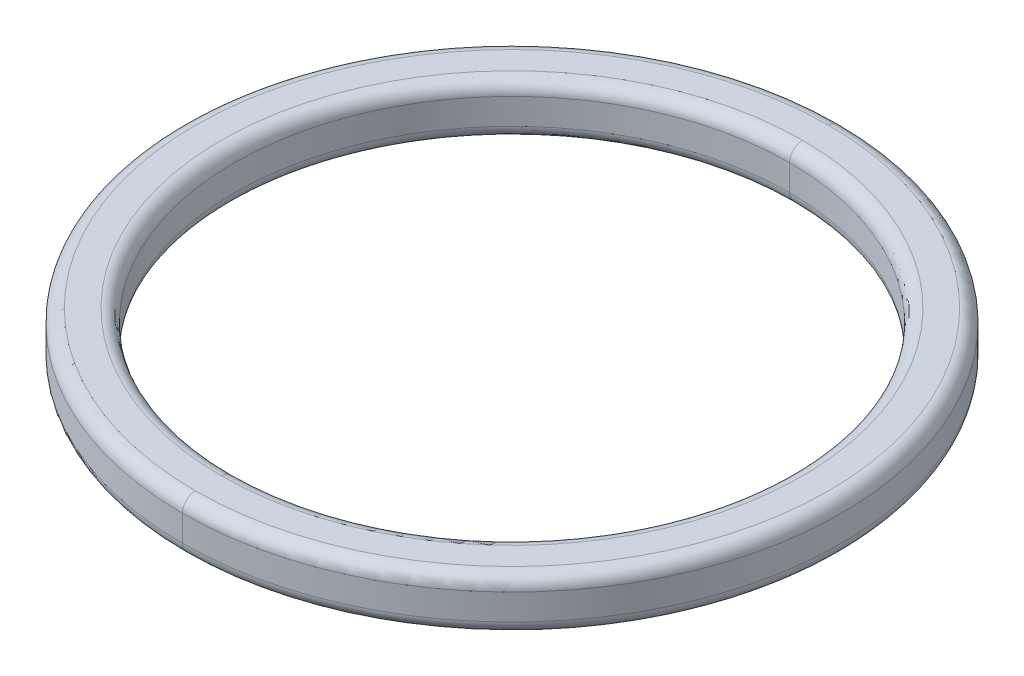
ISO-10303-21;
HEADER;
FILE_DESCRIPTION(('STEP AP214'),'2;1');
FILE_NAME('part.step','',(''),(''),'','','');
FILE_SCHEMA(('AUTOMOTIVE_DESIGN { 1 0 10303 214 1 1 1 1 }'));
ENDSEC;
DATA;
#1=APPLICATION_CONTEXT('core data for automotive mechanical design processes');
#2=APPLICATION_PROTOCOL_DEFINITION('international standard','automotive_design',2000,#1);
#3=PRODUCT_CONTEXT('',#1,'mechanical');
#4=PRODUCT('Part','Part','',(#3));
#5=PRODUCT_RELATED_PRODUCT_CATEGORY('part','',(#4));
#6=PRODUCT_DEFINITION_FORMATION('','',#4);
#7=PRODUCT_DEFINITION_CONTEXT('part definition',#1,'design');
#8=PRODUCT_DEFINITION('design','',#6,#7);
#9=PRODUCT_DEFINITION_SHAPE('','',#8);
#10=(LENGTH_UNIT() NAMED_UNIT(*) SI_UNIT(.MILLI.,.METRE.));
#11=(NAMED_UNIT(*) PLANE_ANGLE_UNIT() SI_UNIT($,.RADIAN.));
#12=(NAMED_UNIT(*) SI_UNIT($,.STERADIAN.) SOLID_ANGLE_UNIT());
#13=UNCERTAINTY_MEASURE_WITH_UNIT(LENGTH_MEASURE(1.E-05),#10,'distance_accuracy_value','');
#14=(GEOMETRIC_REPRESENTATION_CONTEXT(3) GLOBAL_UNCERTAINTY_ASSIGNED_CONTEXT((#13)) GLOBAL_UNIT_ASSIGNED_CONTEXT((#10,
#11,#12)) REPRESENTATION_CONTEXT('',''));
#15=CARTESIAN_POINT('',(0.,0.,0.));
#16=DIRECTION('',(0.,0.,1.));
#17=DIRECTION('',(1.,0.,0.));
#18=AXIS2_PLACEMENT_3D('',#15,#16,#17);
#19=CARTESIAN_POINT('',(0.,0.25,0.));
#20=DIRECTION('',(0.,-1.,0.));
#21=DIRECTION('',(0.,0.,-1.));
#22=AXIS2_PLACEMENT_3D('',#19,#20,#21);
#23=TOROIDAL_SURFACE('',#22,6.1,0.25);
#24=CARTESIAN_POINT('',(0.,0.25,6.1));
#25=DIRECTION('',(1.,0.,0.));
#26=DIRECTION('',(0.,0.,-1.));
#27=AXIS2_PLACEMENT_3D('',#24,#25,#26);
#28=CIRCLE('',#27,0.25);
#29=CARTESIAN_POINT('',(0.,0.5,6.1));
#30=VERTEX_POINT('',#29);
#31=CARTESIAN_POINT('',(0.,0.25,6.35));
#32=VERTEX_POINT('',#31);
#33=EDGE_CURVE('E163',#30,#32,#28,.T.);
#34=ORIENTED_EDGE('',*,*,#33,.F.);
#35=CARTESIAN_POINT('',(0.,0.5,0.));
#36=DIRECTION('',(0.,1.,0.));
#37=DIRECTION('',(0.,0.,-1.));
#38=AXIS2_PLACEMENT_3D('',#35,#36,#37);
#39=CIRCLE('',#38,6.1);
#40=CARTESIAN_POINT('',(0.,0.5,-6.1));
#41=VERTEX_POINT('',#40);
#42=EDGE_CURVE('E25',#41,#30,#39,.T.);
#43=ORIENTED_EDGE('',*,*,#42,.F.);
#44=CARTESIAN_POINT('',(0.,0.25,-6.1));
#45=DIRECTION('',(-1.,0.,0.));
#46=DIRECTION('',(0.,0.,1.));
#47=AXIS2_PLACEMENT_3D('',#44,#45,#46);
#48=CIRCLE('',#47,0.25);
#49=CARTESIAN_POINT('',(0.,0.25,-6.35));
#50=VERTEX_POINT('',#49);
#51=EDGE_CURVE('E115',#41,#50,#48,.T.);
#52=ORIENTED_EDGE('',*,*,#51,.T.);
#53=CARTESIAN_POINT('',(0.,0.25,0.));
#54=DIRECTION('',(0.,-1.,0.));
#55=DIRECTION('',(0.,0.,-1.));
#56=AXIS2_PLACEMENT_3D('',#53,#54,#55);
#57=CIRCLE('',#56,6.35);
#58=EDGE_CURVE('E119',#32,#50,#57,.T.);
#59=ORIENTED_EDGE('',*,*,#58,.F.);
#60=EDGE_LOOP('',(#34,#43,#52,#59));
#61=FACE_BOUND('',#60,.T.);
#62=ADVANCED_FACE('F14',(#61),#23,.T.);
#63=CARTESIAN_POINT('',(0.,0.25,0.));
#64=DIRECTION('',(0.,-1.,0.));
#65=DIRECTION('',(0.,0.,-1.));
#66=AXIS2_PLACEMENT_3D('',#63,#64,#65);
#67=TOROIDAL_SURFACE('',#66,5.6,0.25);
#68=CARTESIAN_POINT('',(0.,0.25,5.6));
#69=DIRECTION('',(1.,0.,0.));
#70=DIRECTION('',(0.,0.,-1.));
#71=AXIS2_PLACEMENT_3D('',#68,#69,#70);
#72=CIRCLE('',#71,0.25);
#73=CARTESIAN_POINT('',(0.,0.25,5.35));
#74=VERTEX_POINT('',#73);
#75=CARTESIAN_POINT('',(0.,0.5,5.6));
#76=VERTEX_POINT('',#75);
#77=EDGE_CURVE('E94',#74,#76,#72,.T.);
#78=ORIENTED_EDGE('',*,*,#77,.F.);
#79=CARTESIAN_POINT('',(0.,0.25,0.));
#80=DIRECTION('',(0.,1.,0.));
#81=DIRECTION('',(0.,0.,-1.));
#82=AXIS2_PLACEMENT_3D('',#79,#80,#81);
#83=CIRCLE('',#82,5.35);
#84=CARTESIAN_POINT('',(0.,0.25,-5.35));
#85=VERTEX_POINT('',#84);
#86=EDGE_CURVE('E122',#85,#74,#83,.T.);
#87=ORIENTED_EDGE('',*,*,#86,.F.);
#88=CARTESIAN_POINT('',(0.,0.25,-5.6));
#89=DIRECTION('',(-1.,0.,0.));
#90=DIRECTION('',(0.,0.,1.));
#91=AXIS2_PLACEMENT_3D('',#88,#89,#90);
#92=CIRCLE('',#91,0.25);
#93=CARTESIAN_POINT('',(0.,0.5,-5.6));
#94=VERTEX_POINT('',#93);
#95=EDGE_CURVE('E97',#85,#94,#92,.T.);
#96=ORIENTED_EDGE('',*,*,#95,.T.);
#97=CARTESIAN_POINT('',(0.,0.5,0.));
#98=DIRECTION('',(0.,-1.,0.));
#99=DIRECTION('',(0.,0.,-1.));
#100=AXIS2_PLACEMENT_3D('',#97,#98,#99);
#101=CIRCLE('',#100,5.6);
#102=EDGE_CURVE('E9',#76,#94,#101,.T.);
#103=ORIENTED_EDGE('',*,*,#102,.F.);
#104=EDGE_LOOP('',(#78,#87,#96,#103));
#105=FACE_BOUND('',#104,.T.);
#106=ADVANCED_FACE('F92',(#105),#67,.T.);
#107=CARTESIAN_POINT('',(0.,-0.25,0.));
#108=DIRECTION('',(0.,1.,0.));
#109=DIRECTION('',(0.,0.,1.));
#110=AXIS2_PLACEMENT_3D('',#107,#108,#109);
#111=TOROIDAL_SURFACE('',#110,6.1,0.25);
#112=CARTESIAN_POINT('',(0.,-0.25,-6.1));
#113=DIRECTION('',(1.,0.,0.));
#114=DIRECTION('',(0.,0.,-1.));
#115=AXIS2_PLACEMENT_3D('',#112,#113,#114);
#116=CIRCLE('',#115,0.25);
#117=CARTESIAN_POINT('',(0.,-0.5,-6.1));
#118=VERTEX_POINT('',#117);
#119=CARTESIAN_POINT('',(0.,-0.25,-6.35));
#120=VERTEX_POINT('',#119);
#121=EDGE_CURVE('E153',#118,#120,#116,.T.);
#122=ORIENTED_EDGE('',*,*,#121,.F.);
#123=CARTESIAN_POINT('',(0.,-0.5,0.));
#124=DIRECTION('',(0.,-1.,0.));
#125=DIRECTION('',(0.,0.,1.));
#126=AXIS2_PLACEMENT_3D('',#123,#124,#125);
#127=CIRCLE('',#126,6.1);
#128=CARTESIAN_POINT('',(0.,-0.5,6.1));
#129=VERTEX_POINT('',#128);
#130=EDGE_CURVE('E121',#129,#118,#127,.T.);
#131=ORIENTED_EDGE('',*,*,#130,.F.);
#132=CARTESIAN_POINT('',(0.,-0.25,6.1));
#133=DIRECTION('',(-1.,0.,0.));
#134=DIRECTION('',(0.,0.,1.));
#135=AXIS2_PLACEMENT_3D('',#132,#133,#134);
#136=CIRCLE('',#135,0.25);
#137=CARTESIAN_POINT('',(0.,-0.25,6.35));
#138=VERTEX_POINT('',#137);
#139=EDGE_CURVE('E139',#129,#138,#136,.T.);
#140=ORIENTED_EDGE('',*,*,#139,.T.);
#141=CARTESIAN_POINT('',(0.,-0.25,0.));
#142=DIRECTION('',(0.,1.,0.));
#143=DIRECTION('',(0.,0.,1.));
#144=AXIS2_PLACEMENT_3D('',#141,#142,#143);
#145=CIRCLE('',#144,6.35);
#146=EDGE_CURVE('E136',#120,#138,#145,.T.);
#147=ORIENTED_EDGE('',*,*,#146,.F.);
#148=EDGE_LOOP('',(#122,#131,#140,#147));
#149=FACE_BOUND('',#148,.T.);
#150=ADVANCED_FACE('F224',(#149),#111,.T.);
#151=CARTESIAN_POINT('',(0.,-0.25,0.));
#152=DIRECTION('',(0.,1.,0.));
#153=DIRECTION('',(0.,0.,1.));
#154=AXIS2_PLACEMENT_3D('',#151,#152,#153);
#155=TOROIDAL_SURFACE('',#154,5.6,0.25);
#156=CARTESIAN_POINT('',(0.,-0.25,-5.6));
#157=DIRECTION('',(1.,0.,0.));
#158=DIRECTION('',(0.,0.,-1.));
#159=AXIS2_PLACEMENT_3D('',#156,#157,#158);
#160=CIRCLE('',#159,0.25);
#161=CARTESIAN_POINT('',(0.,-0.25,-5.35));
#162=VERTEX_POINT('',#161);
#163=CARTESIAN_POINT('',(0.,-0.5,-5.6));
#164=VERTEX_POINT('',#163);
#165=EDGE_CURVE('E145',#162,#164,#160,.T.);
#166=ORIENTED_EDGE('',*,*,#165,.F.);
#167=CARTESIAN_POINT('',(0.,-0.25,0.));
#168=DIRECTION('',(0.,-1.,0.));
#169=DIRECTION('',(0.,0.,1.));
#170=AXIS2_PLACEMENT_3D('',#167,#168,#169);
#171=CIRCLE('',#170,5.35);
#172=CARTESIAN_POINT('',(0.,-0.25,5.35));
#173=VERTEX_POINT('',#172);
#174=EDGE_CURVE('E128',#173,#162,#171,.T.);
#175=ORIENTED_EDGE('',*,*,#174,.F.);
#176=CARTESIAN_POINT('',(0.,-0.25,5.6));
#177=DIRECTION('',(-1.,0.,0.));
#178=DIRECTION('',(0.,0.,1.));
#179=AXIS2_PLACEMENT_3D('',#176,#177,#178);
#180=CIRCLE('',#179,0.25);
#181=CARTESIAN_POINT('',(0.,-0.5,5.6));
#182=VERTEX_POINT('',#181);
#183=EDGE_CURVE('E132',#173,#182,#180,.T.);
#184=ORIENTED_EDGE('',*,*,#183,.T.);
#185=CARTESIAN_POINT('',(0.,-0.5,0.));
#186=DIRECTION('',(0.,1.,0.));
#187=DIRECTION('',(0.,0.,1.));
#188=AXIS2_PLACEMENT_3D('',#185,#186,#187);
#189=CIRCLE('',#188,5.6);
#190=EDGE_CURVE('E39',#164,#182,#189,.T.);
#191=ORIENTED_EDGE('',*,*,#190,.F.);
#192=EDGE_LOOP('',(#166,#175,#184,#191));
#193=FACE_BOUND('',#192,.T.);
#194=ADVANCED_FACE('F254',(#193),#155,.T.);
#195=CARTESIAN_POINT('',(5.35,0.5,0.));
#196=DIRECTION('',(0.,-1.,0.));
#197=DIRECTION('',(0.,0.,-1.));
#198=AXIS2_PLACEMENT_3D('',#195,#196,#197);
#199=PLANE('',#198);
#200=CARTESIAN_POINT('',(0.,0.5,0.));
#201=DIRECTION('',(0.,-1.,0.));
#202=DIRECTION('',(0.,0.,-1.));
#203=AXIS2_PLACEMENT_3D('',#200,#201,#202);
#204=CIRCLE('',#203,5.6);
#205=EDGE_CURVE('E100',#94,#76,#204,.T.);
#206=ORIENTED_EDGE('',*,*,#205,.T.);
#207=ORIENTED_EDGE('',*,*,#102,.T.);
#208=EDGE_LOOP('',(#206,#207));
#209=FACE_BOUND('',#208,.T.);
#210=ORIENTED_EDGE('',*,*,#42,.T.);
#211=CARTESIAN_POINT('',(0.,0.5,0.));
#212=DIRECTION('',(0.,1.,0.));
#213=DIRECTION('',(0.,0.,-1.));
#214=AXIS2_PLACEMENT_3D('',#211,#212,#213);
#215=CIRCLE('',#214,6.1);
#216=EDGE_CURVE('E159',#30,#41,#215,.T.);
#217=ORIENTED_EDGE('',*,*,#216,.T.);
#218=EDGE_LOOP('',(#210,#217));
#219=FACE_BOUND('',#218,.T.);
#220=ADVANCED_FACE('F16',(#209,#219),#199,.F.);
#221=CARTESIAN_POINT('',(0.,4.84722222222223,0.));
#222=DIRECTION('',(0.,1.,0.));
#223=DIRECTION('',(0.,0.,1.));
#224=AXIS2_PLACEMENT_3D('',#221,#222,#223);
#225=CYLINDRICAL_SURFACE('',#224,5.35);
#226=DIRECTION('',(0.,1.,0.));
#227=VECTOR('',#226,1.);
#228=CARTESIAN_POINT('',(0.,4.84722222222223,-5.35));
#229=LINE('',#228,#227);
#230=EDGE_CURVE('E127',#162,#85,#229,.T.);
#231=ORIENTED_EDGE('',*,*,#230,.F.);
#232=CARTESIAN_POINT('',(0.,-0.25,0.));
#233=DIRECTION('',(0.,-1.,0.));
#234=DIRECTION('',(0.,0.,1.));
#235=AXIS2_PLACEMENT_3D('',#232,#233,#234);
#236=CIRCLE('',#235,5.35);
#237=EDGE_CURVE('E143',#162,#173,#236,.T.);
#238=ORIENTED_EDGE('',*,*,#237,.T.);
#239=DIRECTION('',(0.,1.,0.));
#240=VECTOR('',#239,1.);
#241=CARTESIAN_POINT('',(0.,4.84722222222223,5.35));
#242=LINE('',#241,#240);
#243=EDGE_CURVE('E126',#173,#74,#242,.T.);
#244=ORIENTED_EDGE('',*,*,#243,.T.);
#245=CARTESIAN_POINT('',(0.,0.25,0.));
#246=DIRECTION('',(0.,1.,0.));
#247=DIRECTION('',(0.,0.,-1.));
#248=AXIS2_PLACEMENT_3D('',#245,#246,#247);
#249=CIRCLE('',#248,5.35);
#250=EDGE_CURVE('E107',#74,#85,#249,.T.);
#251=ORIENTED_EDGE('',*,*,#250,.T.);
#252=EDGE_LOOP('',(#231,#238,#244,#251));
#253=FACE_BOUND('',#252,.T.);
#254=ADVANCED_FACE('F247',(#253),#225,.F.);
#255=CARTESIAN_POINT('',(5.35,-0.5,0.));
#256=DIRECTION('',(0.,1.,0.));
#257=DIRECTION('',(1.,0.,0.));
#258=AXIS2_PLACEMENT_3D('',#255,#256,#257);
#259=PLANE('',#258);
#260=CARTESIAN_POINT('',(0.,-0.5,0.));
#261=DIRECTION('',(0.,1.,0.));
#262=DIRECTION('',(0.,0.,1.));
#263=AXIS2_PLACEMENT_3D('',#260,#261,#262);
#264=CIRCLE('',#263,5.6);
#265=EDGE_CURVE('E149',#182,#164,#264,.T.);
#266=ORIENTED_EDGE('',*,*,#265,.T.);
#267=ORIENTED_EDGE('',*,*,#190,.T.);
#268=EDGE_LOOP('',(#266,#267));
#269=FACE_BOUND('',#268,.T.);
#270=ORIENTED_EDGE('',*,*,#130,.T.);
#271=CARTESIAN_POINT('',(0.,-0.5,0.));
#272=DIRECTION('',(0.,-1.,0.));
#273=DIRECTION('',(0.,0.,1.));
#274=AXIS2_PLACEMENT_3D('',#271,#272,#273);
#275=CIRCLE('',#274,6.1);
#276=EDGE_CURVE('E168',#118,#129,#275,.T.);
#277=ORIENTED_EDGE('',*,*,#276,.T.);
#278=EDGE_LOOP('',(#270,#277));
#279=FACE_BOUND('',#278,.T.);
#280=ADVANCED_FACE('F249',(#269,#279),#259,.F.);
#281=CARTESIAN_POINT('',(0.,4.84722222222223,0.));
#282=DIRECTION('',(0.,1.,0.));
#283=DIRECTION('',(0.,0.,1.));
#284=AXIS2_PLACEMENT_3D('',#281,#282,#283);
#285=CYLINDRICAL_SURFACE('',#284,6.35);
#286=DIRECTION('',(0.,1.,0.));
#287=VECTOR('',#286,1.);
#288=CARTESIAN_POINT('',(0.,4.84722222222223,-6.35));
#289=LINE('',#288,#287);
#290=EDGE_CURVE('E164',#120,#50,#289,.T.);
#291=ORIENTED_EDGE('',*,*,#290,.F.);
#292=ORIENTED_EDGE('',*,*,#146,.T.);
#293=DIRECTION('',(0.,1.,0.));
#294=VECTOR('',#293,1.);
#295=CARTESIAN_POINT('',(0.,4.84722222222223,6.35));
#296=LINE('',#295,#294);
#297=EDGE_CURVE('E18',#138,#32,#296,.T.);
#298=ORIENTED_EDGE('',*,*,#297,.T.);
#299=ORIENTED_EDGE('',*,*,#58,.T.);
#300=EDGE_LOOP('',(#291,#292,#298,#299));
#301=FACE_BOUND('',#300,.T.);
#302=ADVANCED_FACE('F217',(#301),#285,.T.);
#303=CARTESIAN_POINT('',(0.,4.84722222222223,0.));
#304=DIRECTION('',(0.,1.,0.));
#305=DIRECTION('',(0.,0.,1.));
#306=AXIS2_PLACEMENT_3D('',#303,#304,#305);
#307=CYLINDRICAL_SURFACE('',#306,6.35);
#308=CARTESIAN_POINT('',(0.,-0.25,0.));
#309=DIRECTION('',(0.,1.,0.));
#310=DIRECTION('',(0.,0.,1.));
#311=AXIS2_PLACEMENT_3D('',#308,#309,#310);
#312=CIRCLE('',#311,6.35);
#313=EDGE_CURVE('E144',#138,#120,#312,.T.);
#314=ORIENTED_EDGE('',*,*,#313,.T.);
#315=ORIENTED_EDGE('',*,*,#290,.T.);
#316=CARTESIAN_POINT('',(0.,0.25,0.));
#317=DIRECTION('',(0.,-1.,0.));
#318=DIRECTION('',(0.,0.,-1.));
#319=AXIS2_PLACEMENT_3D('',#316,#317,#318);
#320=CIRCLE('',#319,6.35);
#321=EDGE_CURVE('E189',#50,#32,#320,.T.);
#322=ORIENTED_EDGE('',*,*,#321,.T.);
#323=ORIENTED_EDGE('',*,*,#297,.F.);
#324=EDGE_LOOP('',(#314,#315,#322,#323));
#325=FACE_BOUND('',#324,.T.);
#326=ADVANCED_FACE('F213',(#325),#307,.T.);
#327=CARTESIAN_POINT('',(0.,4.84722222222223,0.));
#328=DIRECTION('',(0.,1.,0.));
#329=DIRECTION('',(0.,0.,1.));
#330=AXIS2_PLACEMENT_3D('',#327,#328,#329);
#331=CYLINDRICAL_SURFACE('',#330,5.35);
#332=ORIENTED_EDGE('',*,*,#174,.T.);
#333=ORIENTED_EDGE('',*,*,#230,.T.);
#334=ORIENTED_EDGE('',*,*,#86,.T.);
#335=ORIENTED_EDGE('',*,*,#243,.F.);
#336=EDGE_LOOP('',(#332,#333,#334,#335));
#337=FACE_BOUND('',#336,.T.);
#338=ADVANCED_FACE('F237',(#337),#331,.F.);
#339=CARTESIAN_POINT('',(0.,-0.25,0.));
#340=DIRECTION('',(0.,1.,0.));
#341=DIRECTION('',(0.,0.,1.));
#342=AXIS2_PLACEMENT_3D('',#339,#340,#341);
#343=TOROIDAL_SURFACE('',#342,5.6,0.25);
#344=ORIENTED_EDGE('',*,*,#237,.F.);
#345=ORIENTED_EDGE('',*,*,#165,.T.);
#346=ORIENTED_EDGE('',*,*,#265,.F.);
#347=ORIENTED_EDGE('',*,*,#183,.F.);
#348=EDGE_LOOP('',(#344,#345,#346,#347));
#349=FACE_BOUND('',#348,.T.);
#350=ADVANCED_FACE('F229',(#349),#343,.T.);
#351=CARTESIAN_POINT('',(0.,-0.25,0.));
#352=DIRECTION('',(0.,1.,0.));
#353=DIRECTION('',(0.,0.,1.));
#354=AXIS2_PLACEMENT_3D('',#351,#352,#353);
#355=TOROIDAL_SURFACE('',#354,6.1,0.25);
#356=ORIENTED_EDGE('',*,*,#276,.F.);
#357=ORIENTED_EDGE('',*,*,#121,.T.);
#358=ORIENTED_EDGE('',*,*,#313,.F.);
#359=ORIENTED_EDGE('',*,*,#139,.F.);
#360=EDGE_LOOP('',(#356,#357,#358,#359));
#361=FACE_BOUND('',#360,.T.);
#362=ADVANCED_FACE('F227',(#361),#355,.T.);
#363=CARTESIAN_POINT('',(0.,0.25,0.));
#364=DIRECTION('',(0.,-1.,0.));
#365=DIRECTION('',(0.,0.,-1.));
#366=AXIS2_PLACEMENT_3D('',#363,#364,#365);
#367=TOROIDAL_SURFACE('',#366,5.6,0.25);
#368=ORIENTED_EDGE('',*,*,#250,.F.);
#369=ORIENTED_EDGE('',*,*,#77,.T.);
#370=ORIENTED_EDGE('',*,*,#205,.F.);
#371=ORIENTED_EDGE('',*,*,#95,.F.);
#372=EDGE_LOOP('',(#368,#369,#370,#371));
#373=FACE_BOUND('',#372,.T.);
#374=ADVANCED_FACE('F105',(#373),#367,.T.);
#375=CARTESIAN_POINT('',(0.,0.25,0.));
#376=DIRECTION('',(0.,-1.,0.));
#377=DIRECTION('',(0.,0.,-1.));
#378=AXIS2_PLACEMENT_3D('',#375,#376,#377);
#379=TOROIDAL_SURFACE('',#378,6.1,0.25);
#380=ORIENTED_EDGE('',*,*,#216,.F.);
#381=ORIENTED_EDGE('',*,*,#33,.T.);
#382=ORIENTED_EDGE('',*,*,#321,.F.);
#383=ORIENTED_EDGE('',*,*,#51,.F.);
#384=EDGE_LOOP('',(#380,#381,#382,#383));
#385=FACE_BOUND('',#384,.T.);
#386=ADVANCED_FACE('F210',(#385),#379,.T.);
#387=CLOSED_SHELL('',(#62,#106,#150,#194,#220,#254,#280,#302,#326,#338,#350,#362,#374,#386));
#388=MANIFOLD_SOLID_BREP('B1',#387);
#389=ADVANCED_BREP_SHAPE_REPRESENTATION('',(#18,#388),#14);
#390=SHAPE_DEFINITION_REPRESENTATION(#9,#389);
ENDSEC;
END-ISO-10303-21;
